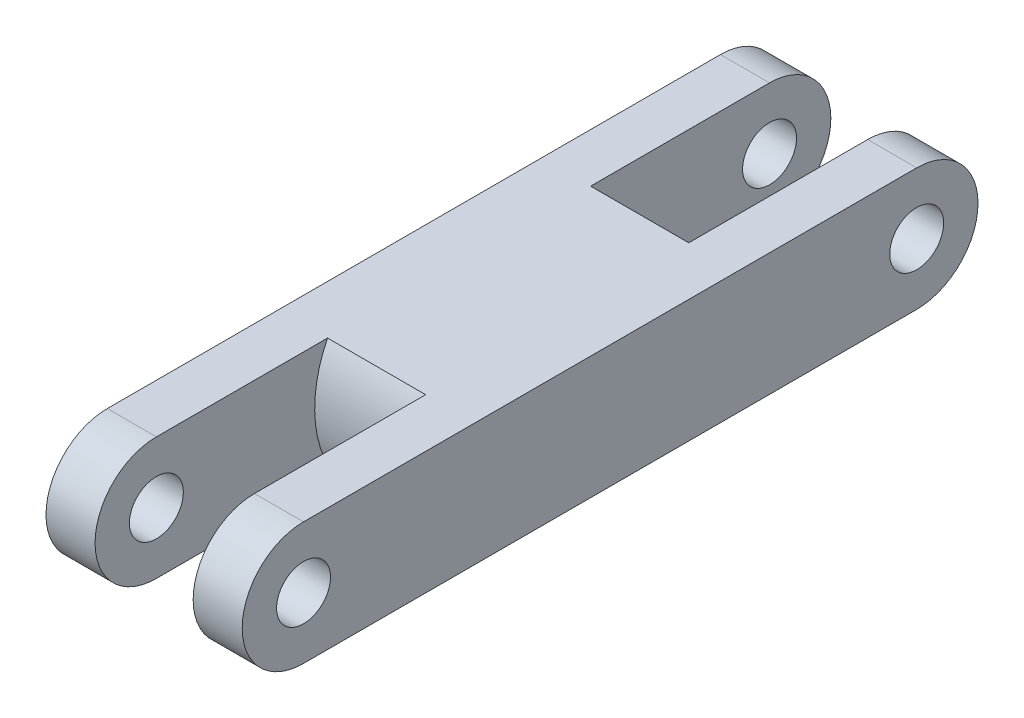
ISO-10303-21;
HEADER;
FILE_DESCRIPTION(('STEP AP214'),'2;1');
FILE_NAME('part.step','',(''),(''),'','','');
FILE_SCHEMA(('AUTOMOTIVE_DESIGN { 1 0 10303 214 1 1 1 1 }'));
ENDSEC;
DATA;
#1=APPLICATION_CONTEXT('core data for automotive mechanical design processes');
#2=APPLICATION_PROTOCOL_DEFINITION('international standard','automotive_design',2000,#1);
#3=PRODUCT_CONTEXT('',#1,'mechanical');
#4=PRODUCT('Part','Part','',(#3));
#5=PRODUCT_RELATED_PRODUCT_CATEGORY('part','',(#4));
#6=PRODUCT_DEFINITION_FORMATION('','',#4);
#7=PRODUCT_DEFINITION_CONTEXT('part definition',#1,'design');
#8=PRODUCT_DEFINITION('design','',#6,#7);
#9=PRODUCT_DEFINITION_SHAPE('','',#8);
#10=(LENGTH_UNIT() NAMED_UNIT(*) SI_UNIT(.MILLI.,.METRE.));
#11=(NAMED_UNIT(*) PLANE_ANGLE_UNIT() SI_UNIT($,.RADIAN.));
#12=(NAMED_UNIT(*) SI_UNIT($,.STERADIAN.) SOLID_ANGLE_UNIT());
#13=UNCERTAINTY_MEASURE_WITH_UNIT(LENGTH_MEASURE(1.E-05),#10,'distance_accuracy_value','');
#14=(GEOMETRIC_REPRESENTATION_CONTEXT(3) GLOBAL_UNCERTAINTY_ASSIGNED_CONTEXT((#13)) GLOBAL_UNIT_ASSIGNED_CONTEXT((#10,
#11,#12)) REPRESENTATION_CONTEXT('',''));
#15=CARTESIAN_POINT('',(0.,0.,0.));
#16=DIRECTION('',(0.,0.,1.));
#17=DIRECTION('',(1.,0.,0.));
#18=AXIS2_PLACEMENT_3D('',#15,#16,#17);
#19=CARTESIAN_POINT('',(4.,0.,12.5));
#20=DIRECTION('',(-1.,0.,0.));
#21=DIRECTION('',(0.,0.,1.));
#22=AXIS2_PLACEMENT_3D('',#19,#20,#21);
#23=CYLINDRICAL_SURFACE('',#22,2.5);
#24=CARTESIAN_POINT('',(-2.,0.,12.5));
#25=DIRECTION('',(1.,0.,0.));
#26=DIRECTION('',(0.,0.,-1.));
#27=AXIS2_PLACEMENT_3D('',#24,#25,#26);
#28=CIRCLE('',#27,2.5);
#29=CARTESIAN_POINT('',(-2.,2.5,12.5));
#30=VERTEX_POINT('',#29);
#31=CARTESIAN_POINT('',(-2.,-2.5,12.5));
#32=VERTEX_POINT('',#31);
#33=EDGE_CURVE('E165',#30,#32,#28,.T.);
#34=ORIENTED_EDGE('',*,*,#33,.F.);
#35=DIRECTION('',(-1.,0.,0.));
#36=VECTOR('',#35,1.);
#37=CARTESIAN_POINT('',(4.,2.5,12.5));
#38=LINE('',#37,#36);
#39=CARTESIAN_POINT('',(-4.,2.5,12.5));
#40=VERTEX_POINT('',#39);
#41=EDGE_CURVE('E140',#30,#40,#38,.T.);
#42=ORIENTED_EDGE('',*,*,#41,.T.);
#43=CARTESIAN_POINT('',(-4.,0.,12.5));
#44=DIRECTION('',(1.,0.,0.));
#45=DIRECTION('',(0.,0.,-1.));
#46=AXIS2_PLACEMENT_3D('',#43,#44,#45);
#47=CIRCLE('',#46,2.5);
#48=CARTESIAN_POINT('',(-4.,-2.5,12.5));
#49=VERTEX_POINT('',#48);
#50=EDGE_CURVE('E187',#40,#49,#47,.T.);
#51=ORIENTED_EDGE('',*,*,#50,.T.);
#52=DIRECTION('',(-1.,0.,0.));
#53=VECTOR('',#52,1.);
#54=CARTESIAN_POINT('',(4.,-2.5,12.5));
#55=LINE('',#54,#53);
#56=EDGE_CURVE('E220',#32,#49,#55,.T.);
#57=ORIENTED_EDGE('',*,*,#56,.F.);
#58=EDGE_LOOP('',(#34,#42,#51,#57));
#59=FACE_BOUND('',#58,.T.);
#60=ADVANCED_FACE('F41',(#59),#23,.T.);
#61=CARTESIAN_POINT('',(4.,-2.5,12.5));
#62=DIRECTION('',(0.,1.,0.));
#63=DIRECTION('',(0.,0.,1.));
#64=AXIS2_PLACEMENT_3D('',#61,#62,#63);
#65=PLANE('',#64);
#66=DIRECTION('',(0.,0.,-1.));
#67=VECTOR('',#66,1.);
#68=CARTESIAN_POINT('',(2.,-2.5,12.5));
#69=LINE('',#68,#67);
#70=CARTESIAN_POINT('',(2.,-2.5,12.5));
#71=VERTEX_POINT('',#70);
#72=CARTESIAN_POINT('',(2.,-2.5,5.2064527001354));
#73=VERTEX_POINT('',#72);
#74=EDGE_CURVE('E62',#71,#73,#69,.T.);
#75=ORIENTED_EDGE('',*,*,#74,.T.);
#76=DIRECTION('',(-1.,0.,0.));
#77=VECTOR('',#76,1.);
#78=CARTESIAN_POINT('',(0.,-2.5,5.2064527001354));
#79=LINE('',#78,#77);
#80=CARTESIAN_POINT('',(-2.,-2.5,5.2064527001354));
#81=VERTEX_POINT('',#80);
#82=EDGE_CURVE('E232',#73,#81,#79,.T.);
#83=ORIENTED_EDGE('',*,*,#82,.T.);
#84=DIRECTION('',(0.,0.,1.));
#85=VECTOR('',#84,1.);
#86=CARTESIAN_POINT('',(-2.,-2.49999999999999,0.));
#87=LINE('',#86,#85);
#88=EDGE_CURVE('E55',#81,#32,#87,.T.);
#89=ORIENTED_EDGE('',*,*,#88,.T.);
#90=ORIENTED_EDGE('',*,*,#56,.T.);
#91=DIRECTION('',(0.,0.,-1.));
#92=VECTOR('',#91,1.);
#93=CARTESIAN_POINT('',(-4.,-2.5,12.5));
#94=LINE('',#93,#92);
#95=CARTESIAN_POINT('',(-4.,-2.5,-12.5));
#96=VERTEX_POINT('',#95);
#97=EDGE_CURVE('E202',#49,#96,#94,.T.);
#98=ORIENTED_EDGE('',*,*,#97,.T.);
#99=DIRECTION('',(-1.,0.,0.));
#100=VECTOR('',#99,1.);
#101=CARTESIAN_POINT('',(4.,-2.5,-12.5));
#102=LINE('',#101,#100);
#103=CARTESIAN_POINT('',(-2.,-2.5,-12.5));
#104=VERTEX_POINT('',#103);
#105=EDGE_CURVE('E216',#104,#96,#102,.T.);
#106=ORIENTED_EDGE('',*,*,#105,.F.);
#107=DIRECTION('',(0.,0.,-1.));
#108=VECTOR('',#107,1.);
#109=CARTESIAN_POINT('',(-2.,-2.5,0.));
#110=LINE('',#109,#108);
#111=CARTESIAN_POINT('',(-2.,-2.49999999999999,-5.52061601851445));
#112=VERTEX_POINT('',#111);
#113=EDGE_CURVE('E154',#112,#104,#110,.T.);
#114=ORIENTED_EDGE('',*,*,#113,.F.);
#115=DIRECTION('',(1.,0.,0.));
#116=VECTOR('',#115,1.);
#117=CARTESIAN_POINT('',(-2.,-2.49999999999999,-5.52061601851445));
#118=LINE('',#117,#116);
#119=CARTESIAN_POINT('',(2.,-2.49999999999999,-5.52061601851445));
#120=VERTEX_POINT('',#119);
#121=EDGE_CURVE('E157',#112,#120,#118,.T.);
#122=ORIENTED_EDGE('',*,*,#121,.T.);
#123=DIRECTION('',(0.,0.,-1.));
#124=VECTOR('',#123,1.);
#125=CARTESIAN_POINT('',(2.,-2.5,0.));
#126=LINE('',#125,#124);
#127=CARTESIAN_POINT('',(2.,-2.5,-12.5));
#128=VERTEX_POINT('',#127);
#129=EDGE_CURVE('E155',#120,#128,#126,.T.);
#130=ORIENTED_EDGE('',*,*,#129,.T.);
#131=CARTESIAN_POINT('',(4.,-2.5,-12.5));
#132=VERTEX_POINT('',#131);
#133=EDGE_CURVE('E217',#132,#128,#102,.T.);
#134=ORIENTED_EDGE('',*,*,#133,.F.);
#135=DIRECTION('',(0.,0.,-1.));
#136=VECTOR('',#135,1.);
#137=CARTESIAN_POINT('',(4.,-2.5,12.5));
#138=LINE('',#137,#136);
#139=CARTESIAN_POINT('',(4.,-2.5,12.5));
#140=VERTEX_POINT('',#139);
#141=EDGE_CURVE('E193',#140,#132,#138,.T.);
#142=ORIENTED_EDGE('',*,*,#141,.F.);
#143=EDGE_CURVE('E221',#140,#71,#55,.T.);
#144=ORIENTED_EDGE('',*,*,#143,.T.);
#145=EDGE_LOOP('',(#75,#83,#89,#90,#98,#106,#114,#122,#130,#134,#142,#144));
#146=FACE_BOUND('',#145,.T.);
#147=ADVANCED_FACE('F241',(#146),#65,.F.);
#148=CARTESIAN_POINT('',(4.,0.,-12.5));
#149=DIRECTION('',(-1.,0.,0.));
#150=DIRECTION('',(0.,0.,1.));
#151=AXIS2_PLACEMENT_3D('',#148,#149,#150);
#152=CYLINDRICAL_SURFACE('',#151,2.5);
#153=CARTESIAN_POINT('',(-2.,0.,-12.5));
#154=DIRECTION('',(1.,0.,0.));
#155=DIRECTION('',(0.,0.,-1.));
#156=AXIS2_PLACEMENT_3D('',#153,#154,#155);
#157=CIRCLE('',#156,2.5);
#158=CARTESIAN_POINT('',(-2.,2.5,-12.5));
#159=VERTEX_POINT('',#158);
#160=EDGE_CURVE('E174',#104,#159,#157,.T.);
#161=ORIENTED_EDGE('',*,*,#160,.F.);
#162=ORIENTED_EDGE('',*,*,#105,.T.);
#163=CARTESIAN_POINT('',(-4.,0.,-12.5));
#164=DIRECTION('',(1.,0.,0.));
#165=DIRECTION('',(0.,0.,-1.));
#166=AXIS2_PLACEMENT_3D('',#163,#164,#165);
#167=CIRCLE('',#166,2.5);
#168=CARTESIAN_POINT('',(-4.,2.5,-12.5));
#169=VERTEX_POINT('',#168);
#170=EDGE_CURVE('E205',#96,#169,#167,.T.);
#171=ORIENTED_EDGE('',*,*,#170,.T.);
#172=DIRECTION('',(-1.,0.,0.));
#173=VECTOR('',#172,1.);
#174=CARTESIAN_POINT('',(4.,2.5,-12.5));
#175=LINE('',#174,#173);
#176=EDGE_CURVE('E212',#159,#169,#175,.T.);
#177=ORIENTED_EDGE('',*,*,#176,.F.);
#178=EDGE_LOOP('',(#161,#162,#171,#177));
#179=FACE_BOUND('',#178,.T.);
#180=ADVANCED_FACE('F256',(#179),#152,.T.);
#181=CARTESIAN_POINT('',(4.,2.5,12.5));
#182=DIRECTION('',(0.,-1.,0.));
#183=DIRECTION('',(0.,0.,-1.));
#184=AXIS2_PLACEMENT_3D('',#181,#182,#183);
#185=PLANE('',#184);
#186=DIRECTION('',(0.,0.,1.));
#187=VECTOR('',#186,1.);
#188=CARTESIAN_POINT('',(2.,2.5,12.5));
#189=LINE('',#188,#187);
#190=CARTESIAN_POINT('',(2.,2.5,-12.5));
#191=VERTEX_POINT('',#190);
#192=CARTESIAN_POINT('',(2.,2.5,-5.2064527001354));
#193=VERTEX_POINT('',#192);
#194=EDGE_CURVE('E168',#191,#193,#189,.T.);
#195=ORIENTED_EDGE('',*,*,#194,.T.);
#196=DIRECTION('',(-1.,0.,0.));
#197=VECTOR('',#196,1.);
#198=CARTESIAN_POINT('',(0.,2.5,-5.2064527001354));
#199=LINE('',#198,#197);
#200=CARTESIAN_POINT('',(-2.,2.5,-5.2064527001354));
#201=VERTEX_POINT('',#200);
#202=EDGE_CURVE('E222',#193,#201,#199,.T.);
#203=ORIENTED_EDGE('',*,*,#202,.T.);
#204=DIRECTION('',(0.,0.,-1.));
#205=VECTOR('',#204,1.);
#206=CARTESIAN_POINT('',(-2.,2.5,0.));
#207=LINE('',#206,#205);
#208=EDGE_CURVE('E152',#201,#159,#207,.T.);
#209=ORIENTED_EDGE('',*,*,#208,.T.);
#210=ORIENTED_EDGE('',*,*,#176,.T.);
#211=DIRECTION('',(0.,0.,1.));
#212=VECTOR('',#211,1.);
#213=CARTESIAN_POINT('',(-4.,2.5,12.5));
#214=LINE('',#213,#212);
#215=EDGE_CURVE('E194',#169,#40,#214,.T.);
#216=ORIENTED_EDGE('',*,*,#215,.T.);
#217=ORIENTED_EDGE('',*,*,#41,.F.);
#218=DIRECTION('',(0.,0.,1.));
#219=VECTOR('',#218,1.);
#220=CARTESIAN_POINT('',(-2.,2.5,0.));
#221=LINE('',#220,#219);
#222=CARTESIAN_POINT('',(-2.,2.5,5.52061601851445));
#223=VERTEX_POINT('',#222);
#224=EDGE_CURVE('E129',#223,#30,#221,.T.);
#225=ORIENTED_EDGE('',*,*,#224,.F.);
#226=DIRECTION('',(1.,0.,0.));
#227=VECTOR('',#226,1.);
#228=CARTESIAN_POINT('',(-2.,2.5,5.52061601851445));
#229=LINE('',#228,#227);
#230=CARTESIAN_POINT('',(2.,2.5,5.52061601851445));
#231=VERTEX_POINT('',#230);
#232=EDGE_CURVE('E138',#223,#231,#229,.T.);
#233=ORIENTED_EDGE('',*,*,#232,.T.);
#234=DIRECTION('',(0.,0.,1.));
#235=VECTOR('',#234,1.);
#236=CARTESIAN_POINT('',(2.,2.5,0.));
#237=LINE('',#236,#235);
#238=CARTESIAN_POINT('',(2.,2.5,12.5));
#239=VERTEX_POINT('',#238);
#240=EDGE_CURVE('E141',#231,#239,#237,.T.);
#241=ORIENTED_EDGE('',*,*,#240,.T.);
#242=CARTESIAN_POINT('',(4.,2.5,12.5));
#243=VERTEX_POINT('',#242);
#244=EDGE_CURVE('E209',#243,#239,#38,.T.);
#245=ORIENTED_EDGE('',*,*,#244,.F.);
#246=DIRECTION('',(0.,0.,1.));
#247=VECTOR('',#246,1.);
#248=CARTESIAN_POINT('',(4.,2.5,12.5));
#249=LINE('',#248,#247);
#250=CARTESIAN_POINT('',(4.,2.5,-12.5));
#251=VERTEX_POINT('',#250);
#252=EDGE_CURVE('E198',#251,#243,#249,.T.);
#253=ORIENTED_EDGE('',*,*,#252,.F.);
#254=EDGE_CURVE('E213',#251,#191,#175,.T.);
#255=ORIENTED_EDGE('',*,*,#254,.T.);
#256=EDGE_LOOP('',(#195,#203,#209,#210,#216,#217,#225,#233,#241,#245,#253,#255));
#257=FACE_BOUND('',#256,.T.);
#258=ADVANCED_FACE('F137',(#257),#185,.F.);
#259=CARTESIAN_POINT('',(4.,0.,-12.5));
#260=DIRECTION('',(-1.,0.,0.));
#261=DIRECTION('',(0.,0.,1.));
#262=AXIS2_PLACEMENT_3D('',#259,#260,#261);
#263=CYLINDRICAL_SURFACE('',#262,1.1);
#264=CARTESIAN_POINT('',(-4.,0.,-12.5));
#265=DIRECTION('',(1.,0.,0.));
#266=DIRECTION('',(0.,0.,-1.));
#267=AXIS2_PLACEMENT_3D('',#264,#265,#266);
#268=CIRCLE('',#267,1.1);
#269=CARTESIAN_POINT('',(-4.,0.,-13.6));
#270=VERTEX_POINT('',#269);
#271=EDGE_CURVE('E181',#270,#270,#268,.T.);
#272=ORIENTED_EDGE('',*,*,#271,.F.);
#273=EDGE_LOOP('',(#272));
#274=FACE_BOUND('',#273,.T.);
#275=CARTESIAN_POINT('',(-2.,0.,-12.5));
#276=DIRECTION('',(1.,0.,0.));
#277=DIRECTION('',(0.,0.,-1.));
#278=AXIS2_PLACEMENT_3D('',#275,#276,#277);
#279=CIRCLE('',#278,1.1);
#280=CARTESIAN_POINT('',(-2.,0.,-13.6));
#281=VERTEX_POINT('',#280);
#282=EDGE_CURVE('E173',#281,#281,#279,.T.);
#283=ORIENTED_EDGE('',*,*,#282,.T.);
#284=EDGE_LOOP('',(#283));
#285=FACE_BOUND('',#284,.T.);
#286=ADVANCED_FACE('F301',(#274,#285),#263,.F.);
#287=CARTESIAN_POINT('',(4.,0.,12.5));
#288=DIRECTION('',(-1.,0.,0.));
#289=DIRECTION('',(0.,0.,1.));
#290=AXIS2_PLACEMENT_3D('',#287,#288,#289);
#291=CYLINDRICAL_SURFACE('',#290,1.1);
#292=CARTESIAN_POINT('',(-4.,0.,12.5));
#293=DIRECTION('',(1.,0.,0.));
#294=DIRECTION('',(0.,0.,-1.));
#295=AXIS2_PLACEMENT_3D('',#292,#293,#294);
#296=CIRCLE('',#295,1.1);
#297=CARTESIAN_POINT('',(-4.,0.,11.4));
#298=VERTEX_POINT('',#297);
#299=EDGE_CURVE('E177',#298,#298,#296,.T.);
#300=ORIENTED_EDGE('',*,*,#299,.F.);
#301=EDGE_LOOP('',(#300));
#302=FACE_BOUND('',#301,.T.);
#303=CARTESIAN_POINT('',(-2.,0.,12.5));
#304=DIRECTION('',(1.,0.,0.));
#305=DIRECTION('',(0.,0.,-1.));
#306=AXIS2_PLACEMENT_3D('',#303,#304,#305);
#307=CIRCLE('',#306,1.1);
#308=CARTESIAN_POINT('',(-2.,0.,11.4));
#309=VERTEX_POINT('',#308);
#310=EDGE_CURVE('E164',#309,#309,#307,.T.);
#311=ORIENTED_EDGE('',*,*,#310,.T.);
#312=EDGE_LOOP('',(#311));
#313=FACE_BOUND('',#312,.T.);
#314=ADVANCED_FACE('F305',(#302,#313),#291,.F.);
#315=CARTESIAN_POINT('',(4.,0.,12.5));
#316=DIRECTION('',(1.,0.,0.));
#317=DIRECTION('',(0.,0.,-1.));
#318=AXIS2_PLACEMENT_3D('',#315,#316,#317);
#319=PLANE('',#318);
#320=CARTESIAN_POINT('',(4.,0.,-12.5));
#321=DIRECTION('',(1.,0.,0.));
#322=DIRECTION('',(0.,0.,-1.));
#323=AXIS2_PLACEMENT_3D('',#320,#321,#322);
#324=CIRCLE('',#323,1.1);
#325=CARTESIAN_POINT('',(4.,0.,-13.6));
#326=VERTEX_POINT('',#325);
#327=EDGE_CURVE('E184',#326,#326,#324,.T.);
#328=ORIENTED_EDGE('',*,*,#327,.F.);
#329=EDGE_LOOP('',(#328));
#330=FACE_BOUND('',#329,.T.);
#331=CARTESIAN_POINT('',(4.,0.,12.5));
#332=DIRECTION('',(1.,0.,0.));
#333=DIRECTION('',(0.,0.,-1.));
#334=AXIS2_PLACEMENT_3D('',#331,#332,#333);
#335=CIRCLE('',#334,2.5);
#336=EDGE_CURVE('E190',#243,#140,#335,.T.);
#337=ORIENTED_EDGE('',*,*,#336,.T.);
#338=ORIENTED_EDGE('',*,*,#141,.T.);
#339=CARTESIAN_POINT('',(4.,0.,-12.5));
#340=DIRECTION('',(1.,0.,0.));
#341=DIRECTION('',(0.,0.,-1.));
#342=AXIS2_PLACEMENT_3D('',#339,#340,#341);
#343=CIRCLE('',#342,2.5);
#344=EDGE_CURVE('E196',#132,#251,#343,.T.);
#345=ORIENTED_EDGE('',*,*,#344,.T.);
#346=ORIENTED_EDGE('',*,*,#252,.T.);
#347=EDGE_LOOP('',(#337,#338,#345,#346));
#348=FACE_BOUND('',#347,.T.);
#349=CARTESIAN_POINT('',(4.,0.,12.5));
#350=DIRECTION('',(1.,0.,0.));
#351=DIRECTION('',(0.,0.,-1.));
#352=AXIS2_PLACEMENT_3D('',#349,#350,#351);
#353=CIRCLE('',#352,1.1);
#354=CARTESIAN_POINT('',(4.,0.,11.4));
#355=VERTEX_POINT('',#354);
#356=EDGE_CURVE('E178',#355,#355,#353,.T.);
#357=ORIENTED_EDGE('',*,*,#356,.F.);
#358=EDGE_LOOP('',(#357));
#359=FACE_BOUND('',#358,.T.);
#360=ADVANCED_FACE('F275',(#330,#348,#359),#319,.T.);
#361=CARTESIAN_POINT('',(-4.,0.,12.5));
#362=DIRECTION('',(1.,0.,0.));
#363=DIRECTION('',(0.,0.,-1.));
#364=AXIS2_PLACEMENT_3D('',#361,#362,#363);
#365=PLANE('',#364);
#366=ORIENTED_EDGE('',*,*,#50,.F.);
#367=ORIENTED_EDGE('',*,*,#215,.F.);
#368=ORIENTED_EDGE('',*,*,#170,.F.);
#369=ORIENTED_EDGE('',*,*,#97,.F.);
#370=EDGE_LOOP('',(#366,#367,#368,#369));
#371=FACE_BOUND('',#370,.T.);
#372=ORIENTED_EDGE('',*,*,#271,.T.);
#373=EDGE_LOOP('',(#372));
#374=FACE_BOUND('',#373,.T.);
#375=ORIENTED_EDGE('',*,*,#299,.T.);
#376=EDGE_LOOP('',(#375));
#377=FACE_BOUND('',#376,.T.);
#378=ADVANCED_FACE('F248',(#371,#374,#377),#365,.F.);
#379=ORIENTED_EDGE('',*,*,#244,.T.);
#380=CARTESIAN_POINT('',(2.,0.,12.5));
#381=DIRECTION('',(1.,0.,0.));
#382=DIRECTION('',(0.,0.,-1.));
#383=AXIS2_PLACEMENT_3D('',#380,#381,#382);
#384=CIRCLE('',#383,2.5);
#385=EDGE_CURVE('E147',#239,#71,#384,.T.);
#386=ORIENTED_EDGE('',*,*,#385,.T.);
#387=ORIENTED_EDGE('',*,*,#143,.F.);
#388=ORIENTED_EDGE('',*,*,#336,.F.);
#389=EDGE_LOOP('',(#379,#386,#387,#388));
#390=FACE_BOUND('',#389,.T.);
#391=ADVANCED_FACE('F281',(#390),#23,.T.);
#392=ORIENTED_EDGE('',*,*,#133,.T.);
#393=CARTESIAN_POINT('',(2.,0.,-12.5));
#394=DIRECTION('',(1.,0.,0.));
#395=DIRECTION('',(0.,0.,-1.));
#396=AXIS2_PLACEMENT_3D('',#393,#394,#395);
#397=CIRCLE('',#396,2.5);
#398=EDGE_CURVE('E170',#128,#191,#397,.T.);
#399=ORIENTED_EDGE('',*,*,#398,.T.);
#400=ORIENTED_EDGE('',*,*,#254,.F.);
#401=ORIENTED_EDGE('',*,*,#344,.F.);
#402=EDGE_LOOP('',(#392,#399,#400,#401));
#403=FACE_BOUND('',#402,.T.);
#404=ADVANCED_FACE('F272',(#403),#152,.T.);
#405=CARTESIAN_POINT('',(2.,0.,-12.5));
#406=DIRECTION('',(1.,0.,0.));
#407=DIRECTION('',(0.,0.,-1.));
#408=AXIS2_PLACEMENT_3D('',#405,#406,#407);
#409=CIRCLE('',#408,1.1);
#410=CARTESIAN_POINT('',(2.,0.,-13.6));
#411=VERTEX_POINT('',#410);
#412=EDGE_CURVE('E167',#411,#411,#409,.T.);
#413=ORIENTED_EDGE('',*,*,#412,.F.);
#414=EDGE_LOOP('',(#413));
#415=FACE_BOUND('',#414,.T.);
#416=ORIENTED_EDGE('',*,*,#327,.T.);
#417=EDGE_LOOP('',(#416));
#418=FACE_BOUND('',#417,.T.);
#419=ADVANCED_FACE('F288',(#415,#418),#263,.F.);
#420=CARTESIAN_POINT('',(2.,0.,12.5));
#421=DIRECTION('',(1.,0.,0.));
#422=DIRECTION('',(0.,0.,-1.));
#423=AXIS2_PLACEMENT_3D('',#420,#421,#422);
#424=CIRCLE('',#423,1.1);
#425=CARTESIAN_POINT('',(2.,0.,11.4));
#426=VERTEX_POINT('',#425);
#427=EDGE_CURVE('E144',#426,#426,#424,.T.);
#428=ORIENTED_EDGE('',*,*,#427,.F.);
#429=EDGE_LOOP('',(#428));
#430=FACE_BOUND('',#429,.T.);
#431=ORIENTED_EDGE('',*,*,#356,.T.);
#432=EDGE_LOOP('',(#431));
#433=FACE_BOUND('',#432,.T.);
#434=ADVANCED_FACE('F309',(#430,#433),#291,.F.);
#435=CARTESIAN_POINT('',(-2.,0.,0.));
#436=DIRECTION('',(1.,0.,0.));
#437=DIRECTION('',(0.,0.,-1.));
#438=AXIS2_PLACEMENT_3D('',#435,#436,#437);
#439=PLANE('',#438);
#440=ORIENTED_EDGE('',*,*,#310,.F.);
#441=EDGE_LOOP('',(#440));
#442=FACE_BOUND('',#441,.T.);
#443=ORIENTED_EDGE('',*,*,#33,.T.);
#444=ORIENTED_EDGE('',*,*,#88,.F.);
#445=CARTESIAN_POINT('',(-2.,0.271359206186198,1.0447741745538));
#446=DIRECTION('',(1.,0.,0.));
#447=DIRECTION('',(0.,0.,-1.));
#448=AXIS2_PLACEMENT_3D('',#445,#446,#447);
#449=CIRCLE('',#448,5.);
#450=EDGE_CURVE('E11',#81,#223,#449,.F.);
#451=ORIENTED_EDGE('',*,*,#450,.T.);
#452=ORIENTED_EDGE('',*,*,#224,.T.);
#453=EDGE_LOOP('',(#443,#444,#451,#452));
#454=FACE_BOUND('',#453,.T.);
#455=ADVANCED_FACE('F128',(#442,#454),#439,.T.);
#456=CARTESIAN_POINT('',(2.,0.,0.));
#457=DIRECTION('',(1.,0.,0.));
#458=DIRECTION('',(0.,0.,-1.));
#459=AXIS2_PLACEMENT_3D('',#456,#457,#458);
#460=PLANE('',#459);
#461=ORIENTED_EDGE('',*,*,#427,.T.);
#462=EDGE_LOOP('',(#461));
#463=FACE_BOUND('',#462,.T.);
#464=ORIENTED_EDGE('',*,*,#385,.F.);
#465=ORIENTED_EDGE('',*,*,#240,.F.);
#466=CARTESIAN_POINT('',(2.,0.271359206186198,1.0447741745538));
#467=DIRECTION('',(1.,0.,0.));
#468=DIRECTION('',(0.,0.,-1.));
#469=AXIS2_PLACEMENT_3D('',#466,#467,#468);
#470=CIRCLE('',#469,5.);
#471=EDGE_CURVE('E49',#231,#73,#470,.T.);
#472=ORIENTED_EDGE('',*,*,#471,.T.);
#473=ORIENTED_EDGE('',*,*,#74,.F.);
#474=EDGE_LOOP('',(#464,#465,#472,#473));
#475=FACE_BOUND('',#474,.T.);
#476=ADVANCED_FACE('F240',(#463,#475),#460,.F.);
#477=CARTESIAN_POINT('',(-2.,0.,0.));
#478=DIRECTION('',(1.,0.,0.));
#479=DIRECTION('',(0.,0.,-1.));
#480=AXIS2_PLACEMENT_3D('',#477,#478,#479);
#481=PLANE('',#480);
#482=ORIENTED_EDGE('',*,*,#282,.F.);
#483=EDGE_LOOP('',(#482));
#484=FACE_BOUND('',#483,.T.);
#485=ORIENTED_EDGE('',*,*,#113,.T.);
#486=ORIENTED_EDGE('',*,*,#160,.T.);
#487=ORIENTED_EDGE('',*,*,#208,.F.);
#488=CARTESIAN_POINT('',(-2.,-0.271359206186193,-1.0447741745538));
#489=DIRECTION('',(1.,0.,0.));
#490=DIRECTION('',(0.,0.,-1.));
#491=AXIS2_PLACEMENT_3D('',#488,#489,#490);
#492=CIRCLE('',#491,5.);
#493=EDGE_CURVE('E237',#201,#112,#492,.F.);
#494=ORIENTED_EDGE('',*,*,#493,.T.);
#495=EDGE_LOOP('',(#485,#486,#487,#494));
#496=FACE_BOUND('',#495,.T.);
#497=ADVANCED_FACE('F259',(#484,#496),#481,.T.);
#498=CARTESIAN_POINT('',(2.,0.,0.));
#499=DIRECTION('',(1.,0.,0.));
#500=DIRECTION('',(0.,0.,-1.));
#501=AXIS2_PLACEMENT_3D('',#498,#499,#500);
#502=PLANE('',#501);
#503=ORIENTED_EDGE('',*,*,#412,.T.);
#504=EDGE_LOOP('',(#503));
#505=FACE_BOUND('',#504,.T.);
#506=ORIENTED_EDGE('',*,*,#129,.F.);
#507=CARTESIAN_POINT('',(2.,-0.271359206186193,-1.0447741745538));
#508=DIRECTION('',(1.,0.,0.));
#509=DIRECTION('',(0.,0.,-1.));
#510=AXIS2_PLACEMENT_3D('',#507,#508,#509);
#511=CIRCLE('',#510,5.);
#512=EDGE_CURVE('E234',#120,#193,#511,.T.);
#513=ORIENTED_EDGE('',*,*,#512,.T.);
#514=ORIENTED_EDGE('',*,*,#194,.F.);
#515=ORIENTED_EDGE('',*,*,#398,.F.);
#516=EDGE_LOOP('',(#506,#513,#514,#515));
#517=FACE_BOUND('',#516,.T.);
#518=ADVANCED_FACE('F269',(#505,#517),#502,.F.);
#519=CARTESIAN_POINT('',(-2.,-0.271359206186193,-1.0447741745538));
#520=DIRECTION('',(-1.,0.,0.));
#521=DIRECTION('',(0.,0.,1.));
#522=AXIS2_PLACEMENT_3D('',#519,#520,#521);
#523=CYLINDRICAL_SURFACE('',#522,5.);
#524=ORIENTED_EDGE('',*,*,#493,.F.);
#525=ORIENTED_EDGE('',*,*,#202,.F.);
#526=ORIENTED_EDGE('',*,*,#512,.F.);
#527=ORIENTED_EDGE('',*,*,#121,.F.);
#528=EDGE_LOOP('',(#524,#525,#526,#527));
#529=FACE_BOUND('',#528,.T.);
#530=ADVANCED_FACE('F263',(#529),#523,.T.);
#531=CARTESIAN_POINT('',(-2.,0.271359206186198,1.0447741745538));
#532=DIRECTION('',(-1.,0.,0.));
#533=DIRECTION('',(0.,0.,1.));
#534=AXIS2_PLACEMENT_3D('',#531,#532,#533);
#535=CYLINDRICAL_SURFACE('',#534,5.);
#536=ORIENTED_EDGE('',*,*,#450,.F.);
#537=ORIENTED_EDGE('',*,*,#82,.F.);
#538=ORIENTED_EDGE('',*,*,#471,.F.);
#539=ORIENTED_EDGE('',*,*,#232,.F.);
#540=EDGE_LOOP('',(#536,#537,#538,#539));
#541=FACE_BOUND('',#540,.T.);
#542=ADVANCED_FACE('F43',(#541),#535,.T.);
#543=CLOSED_SHELL('',(#60,#147,#180,#258,#286,#314,#360,#378,#391,#404,#419,#434,#455,#476,#497,
#518,#530,#542));
#544=MANIFOLD_SOLID_BREP('B2',#543);
#545=ADVANCED_BREP_SHAPE_REPRESENTATION('',(#18,#544),#14);
#546=SHAPE_DEFINITION_REPRESENTATION(#9,#545);
ENDSEC;
END-ISO-10303-21;
